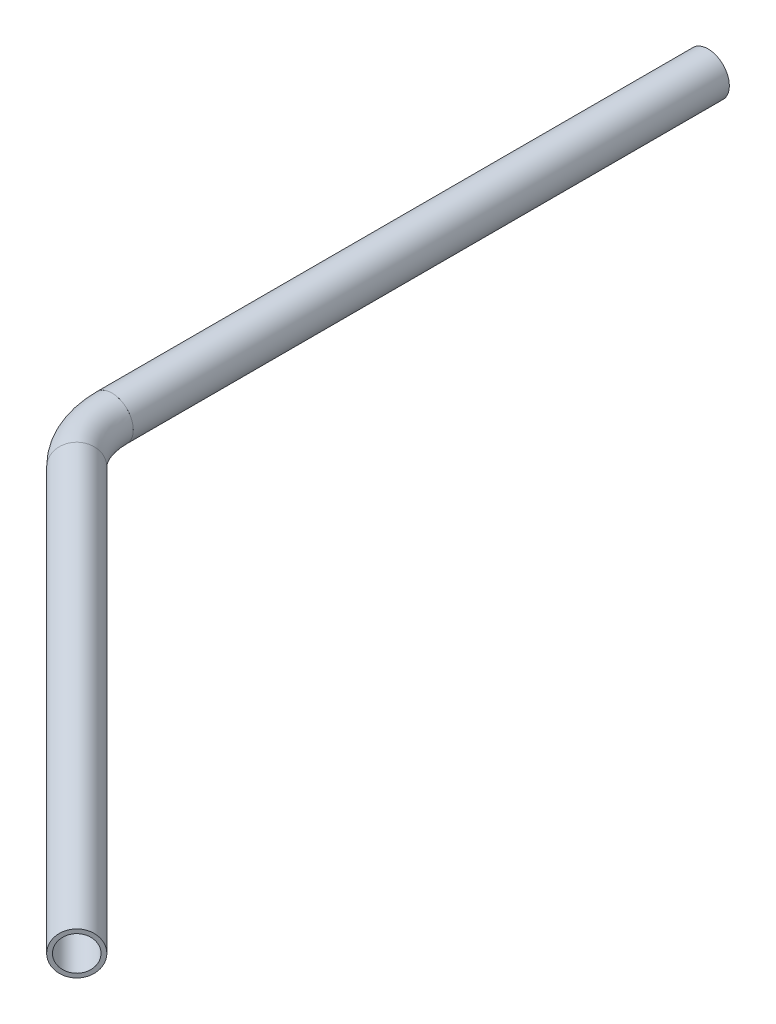
ISO-10303-21;
HEADER;
FILE_DESCRIPTION(('STEP AP214'),'2;1');
FILE_NAME('part.step','',(''),(''),'','','');
FILE_SCHEMA(('AUTOMOTIVE_DESIGN { 1 0 10303 214 1 1 1 1 }'));
ENDSEC;
DATA;
#1=APPLICATION_CONTEXT('core data for automotive mechanical design processes');
#2=APPLICATION_PROTOCOL_DEFINITION('international standard','automotive_design',2000,#1);
#3=PRODUCT_CONTEXT('',#1,'mechanical');
#4=PRODUCT('Part','Part','',(#3));
#5=PRODUCT_RELATED_PRODUCT_CATEGORY('part','',(#4));
#6=PRODUCT_DEFINITION_FORMATION('','',#4);
#7=PRODUCT_DEFINITION_CONTEXT('part definition',#1,'design');
#8=PRODUCT_DEFINITION('design','',#6,#7);
#9=PRODUCT_DEFINITION_SHAPE('','',#8);
#10=(LENGTH_UNIT() NAMED_UNIT(*) SI_UNIT(.MILLI.,.METRE.));
#11=(NAMED_UNIT(*) PLANE_ANGLE_UNIT() SI_UNIT($,.RADIAN.));
#12=(NAMED_UNIT(*) SI_UNIT($,.STERADIAN.) SOLID_ANGLE_UNIT());
#13=UNCERTAINTY_MEASURE_WITH_UNIT(LENGTH_MEASURE(1.E-05),#10,'distance_accuracy_value','');
#14=(GEOMETRIC_REPRESENTATION_CONTEXT(3) GLOBAL_UNCERTAINTY_ASSIGNED_CONTEXT((#13)) GLOBAL_UNIT_ASSIGNED_CONTEXT((#10,
#11,#12)) REPRESENTATION_CONTEXT('',''));
#15=CARTESIAN_POINT('',(0.,0.,0.));
#16=DIRECTION('',(0.,0.,1.));
#17=DIRECTION('',(1.,0.,0.));
#18=AXIS2_PLACEMENT_3D('',#15,#16,#17);
#19=CARTESIAN_POINT('',(19.7410029480264,0.,19.7410029480266));
#20=DIRECTION('',(0.707106781186544,0.,0.707106781186551));
#21=DIRECTION('',(0.707106781186551,0.,-0.707106781186544));
#22=AXIS2_PLACEMENT_3D('',#19,#20,#21);
#23=CYLINDRICAL_SURFACE('',#22,13.6);
#24=CARTESIAN_POINT('',(353.553390593272,0.,353.553390593275));
#25=DIRECTION('',(-0.707106781186544,0.,-0.707106781186551));
#26=DIRECTION('',(-0.707106781186551,0.,0.707106781186544));
#27=AXIS2_PLACEMENT_3D('',#24,#25,#26);
#28=CIRCLE('',#27,13.6);
#29=CARTESIAN_POINT('',(343.936738369135,0.,363.170042817412));
#30=VERTEX_POINT('',#29);
#31=EDGE_CURVE('E57',#30,#30,#28,.T.);
#32=ORIENTED_EDGE('',*,*,#31,.F.);
#33=EDGE_LOOP('',(#32));
#34=FACE_BOUND('',#33,.T.);
#35=CARTESIAN_POINT('',(19.7410029480265,0.,19.7410029480266));
#36=DIRECTION('',(-0.707106781186544,0.,-0.707106781186551));
#37=DIRECTION('',(-0.707106781186551,0.,0.707106781186544));
#38=AXIS2_PLACEMENT_3D('',#35,#36,#37);
#39=CIRCLE('',#38,13.6);
#40=CARTESIAN_POINT('',(10.1243507238894,0.,29.3576551721636));
#41=VERTEX_POINT('',#40);
#42=EDGE_CURVE('E53',#41,#41,#39,.T.);
#43=ORIENTED_EDGE('',*,*,#42,.T.);
#44=EDGE_LOOP('',(#43));
#45=FACE_BOUND('',#44,.T.);
#46=ADVANCED_FACE('F49',(#34,#45),#23,.F.);
#47=CARTESIAN_POINT('',(19.7410029480264,0.,19.7410029480266));
#48=DIRECTION('',(0.707106781186544,0.,0.707106781186551));
#49=DIRECTION('',(0.707106781186551,0.,-0.707106781186544));
#50=AXIS2_PLACEMENT_3D('',#47,#48,#49);
#51=CYLINDRICAL_SURFACE('',#50,16.85);
#52=CARTESIAN_POINT('',(353.553390593272,0.,353.553390593275));
#53=DIRECTION('',(-0.707106781186544,0.,-0.707106781186551));
#54=DIRECTION('',(-0.707106781186551,0.,0.707106781186544));
#55=AXIS2_PLACEMENT_3D('',#52,#53,#54);
#56=CIRCLE('',#55,16.85);
#57=CARTESIAN_POINT('',(341.638641330279,0.,365.468139856269));
#58=VERTEX_POINT('',#57);
#59=EDGE_CURVE('E61',#58,#58,#56,.T.);
#60=ORIENTED_EDGE('',*,*,#59,.T.);
#61=EDGE_LOOP('',(#60));
#62=FACE_BOUND('',#61,.T.);
#63=CARTESIAN_POINT('',(19.7410029480265,0.,19.7410029480266));
#64=DIRECTION('',(-0.707106781186544,0.,-0.707106781186551));
#65=DIRECTION('',(-0.707106781186551,0.,0.707106781186544));
#66=AXIS2_PLACEMENT_3D('',#63,#64,#65);
#67=CIRCLE('',#66,16.85);
#68=CARTESIAN_POINT('',(7.82625368503309,0.,31.6557522110199));
#69=VERTEX_POINT('',#68);
#70=EDGE_CURVE('E12',#69,#69,#67,.T.);
#71=ORIENTED_EDGE('',*,*,#70,.F.);
#72=EDGE_LOOP('',(#71));
#73=FACE_BOUND('',#72,.T.);
#74=ADVANCED_FACE('F76',(#62,#73),#51,.T.);
#75=CARTESIAN_POINT('',(353.553390593272,0.,353.553390593275));
#76=DIRECTION('',(-0.707106781186544,0.,-0.707106781186551));
#77=DIRECTION('',(-0.707106781186551,0.,0.707106781186544));
#78=AXIS2_PLACEMENT_3D('',#75,#76,#77);
#79=PLANE('',#78);
#80=ORIENTED_EDGE('',*,*,#31,.T.);
#81=EDGE_LOOP('',(#80));
#82=FACE_BOUND('',#81,.T.);
#83=ORIENTED_EDGE('',*,*,#59,.F.);
#84=EDGE_LOOP('',(#83));
#85=FACE_BOUND('',#84,.T.);
#86=ADVANCED_FACE('F72',(#82,#85),#79,.F.);
#87=CARTESIAN_POINT('',(19.7410029480265,0.,19.7410029480267));
#88=DIRECTION('',(-0.707106781186544,0.,-0.707106781186551));
#89=DIRECTION('',(-0.707106781186551,0.,0.707106781186544));
#90=AXIS2_PLACEMENT_3D('',#87,#88,#89);
#91=PLANE('',#90);
#92=ORIENTED_EDGE('',*,*,#42,.F.);
#93=EDGE_LOOP('',(#92));
#94=FACE_BOUND('',#93,.T.);
#95=ORIENTED_EDGE('',*,*,#70,.T.);
#96=EDGE_LOOP('',(#95));
#97=FACE_BOUND('',#96,.T.);
#98=ADVANCED_FACE('F51',(#94,#97),#91,.T.);
#99=CLOSED_SHELL('',(#46,#74,#86,#98));
#100=MANIFOLD_SOLID_BREP('B2',#99);
#101=CARTESIAN_POINT('',(67.4,0.,-27.9179941039464));
#102=DIRECTION('',(0.,1.,0.));
#103=DIRECTION('',(0.,0.,1.));
#104=AXIS2_PLACEMENT_3D('',#101,#102,#103);
#105=TOROIDAL_SURFACE('',#104,67.4,13.6);
#106=CARTESIAN_POINT('',(0.,0.,-27.9179941039464));
#107=DIRECTION('',(0.,0.,-1.));
#108=DIRECTION('',(-1.,0.,0.));
#109=AXIS2_PLACEMENT_3D('',#106,#107,#108);
#110=CIRCLE('',#109,13.6);
#111=CARTESIAN_POINT('',(-13.6,0.,-27.9179941039464));
#112=VERTEX_POINT('',#111);
#113=EDGE_CURVE('E154',#112,#112,#110,.T.);
#114=CARTESIAN_POINT('',(19.7410029480265,0.,19.7410029480266));
#115=DIRECTION('',(0.707106781186544,0.,0.707106781186551));
#116=DIRECTION('',(0.707106781186551,0.,-0.707106781186544));
#117=AXIS2_PLACEMENT_3D('',#114,#115,#116);
#118=CIRCLE('',#117,13.6);
#119=CARTESIAN_POINT('',(10.1243507238894,0.,29.3576551721636));
#120=VERTEX_POINT('',#119);
#121=EDGE_CURVE('E144',#120,#120,#118,.T.);
#122=CARTESIAN_POINT('',(67.4,0.,-27.9179941039464));
#123=DIRECTION('',(0.,1.,0.));
#124=DIRECTION('',(0.,0.,1.));
#125=AXIS2_PLACEMENT_3D('',#122,#123,#124);
#126=CIRCLE('',#125,81.);
#127=EDGE_CURVE('',#112,#120,#126,.T.);
#128=ORIENTED_EDGE('',*,*,#113,.T.);
#129=ORIENTED_EDGE('',*,*,#121,.T.);
#130=ORIENTED_EDGE('',*,*,#127,.T.);
#131=ORIENTED_EDGE('',*,*,#127,.F.);
#132=EDGE_LOOP('',(#128,#130,#129,#131));
#133=FACE_BOUND('',#132,.T.);
#134=ADVANCED_FACE('F140',(#133),#105,.F.);
#135=CARTESIAN_POINT('',(67.4,0.,-27.9179941039464));
#136=DIRECTION('',(0.,1.,0.));
#137=DIRECTION('',(0.,0.,1.));
#138=AXIS2_PLACEMENT_3D('',#135,#136,#137);
#139=TOROIDAL_SURFACE('',#138,67.4,16.85);
#140=CARTESIAN_POINT('',(0.,0.,-27.9179941039464));
#141=DIRECTION('',(0.,0.,-1.));
#142=DIRECTION('',(-1.,0.,0.));
#143=AXIS2_PLACEMENT_3D('',#140,#141,#142);
#144=CIRCLE('',#143,16.85);
#145=CARTESIAN_POINT('',(-16.85,0.,-27.9179941039464));
#146=VERTEX_POINT('',#145);
#147=EDGE_CURVE('E148',#146,#146,#144,.T.);
#148=CARTESIAN_POINT('',(19.7410029480265,0.,19.7410029480266));
#149=DIRECTION('',(0.707106781186544,0.,0.707106781186551));
#150=DIRECTION('',(0.707106781186551,0.,-0.707106781186544));
#151=AXIS2_PLACEMENT_3D('',#148,#149,#150);
#152=CIRCLE('',#151,16.85);
#153=CARTESIAN_POINT('',(7.82625368503306,0.,31.6557522110199));
#154=VERTEX_POINT('',#153);
#155=EDGE_CURVE('E48',#154,#154,#152,.T.);
#156=CARTESIAN_POINT('',(67.4,0.,-27.9179941039464));
#157=DIRECTION('',(0.,1.,0.));
#158=DIRECTION('',(0.,0.,1.));
#159=AXIS2_PLACEMENT_3D('',#156,#157,#158);
#160=CIRCLE('',#159,84.25);
#161=EDGE_CURVE('',#146,#154,#160,.T.);
#162=ORIENTED_EDGE('',*,*,#147,.F.);
#163=ORIENTED_EDGE('',*,*,#155,.F.);
#164=ORIENTED_EDGE('',*,*,#161,.T.);
#165=ORIENTED_EDGE('',*,*,#161,.F.);
#166=EDGE_LOOP('',(#162,#164,#163,#165));
#167=FACE_BOUND('',#166,.T.);
#168=ADVANCED_FACE('F167',(#167),#139,.T.);
#169=CARTESIAN_POINT('',(0.,0.,-27.9179941039464));
#170=DIRECTION('',(0.,0.,-1.));
#171=DIRECTION('',(-1.,0.,0.));
#172=AXIS2_PLACEMENT_3D('',#169,#170,#171);
#173=PLANE('',#172);
#174=ORIENTED_EDGE('',*,*,#113,.F.);
#175=EDGE_LOOP('',(#174));
#176=FACE_BOUND('',#175,.T.);
#177=ORIENTED_EDGE('',*,*,#147,.T.);
#178=EDGE_LOOP('',(#177));
#179=FACE_BOUND('',#178,.T.);
#180=ADVANCED_FACE('F163',(#176,#179),#173,.T.);
#181=CARTESIAN_POINT('',(19.7410029480265,0.,19.7410029480267));
#182=DIRECTION('',(0.707106781186544,0.,0.707106781186551));
#183=DIRECTION('',(0.707106781186551,0.,-0.707106781186544));
#184=AXIS2_PLACEMENT_3D('',#181,#182,#183);
#185=PLANE('',#184);
#186=ORIENTED_EDGE('',*,*,#121,.F.);
#187=EDGE_LOOP('',(#186));
#188=FACE_BOUND('',#187,.T.);
#189=ORIENTED_EDGE('',*,*,#155,.T.);
#190=EDGE_LOOP('',(#189));
#191=FACE_BOUND('',#190,.T.);
#192=ADVANCED_FACE('F142',(#188,#191),#185,.T.);
#193=CLOSED_SHELL('',(#134,#168,#180,#192));
#194=MANIFOLD_SOLID_BREP('B7',#193);
#195=CARTESIAN_POINT('',(0.,0.,-500.));
#196=DIRECTION('',(0.,0.,1.));
#197=DIRECTION('',(1.,0.,0.));
#198=AXIS2_PLACEMENT_3D('',#195,#196,#197);
#199=CYLINDRICAL_SURFACE('',#198,13.6);
#200=CARTESIAN_POINT('',(0.,0.,-500.));
#201=DIRECTION('',(0.,0.,-1.));
#202=DIRECTION('',(-1.,0.,0.));
#203=AXIS2_PLACEMENT_3D('',#200,#201,#202);
#204=CIRCLE('',#203,13.6);
#205=CARTESIAN_POINT('',(-13.6,0.,-500.));
#206=VERTEX_POINT('',#205);
#207=EDGE_CURVE('E240',#206,#206,#204,.T.);
#208=ORIENTED_EDGE('',*,*,#207,.T.);
#209=EDGE_LOOP('',(#208));
#210=FACE_BOUND('',#209,.T.);
#211=CARTESIAN_POINT('',(0.,0.,-27.9179941039464));
#212=DIRECTION('',(0.,0.,1.));
#213=DIRECTION('',(1.,0.,0.));
#214=AXIS2_PLACEMENT_3D('',#211,#212,#213);
#215=CIRCLE('',#214,13.6);
#216=CARTESIAN_POINT('',(13.6,0.,-27.9179941039464));
#217=VERTEX_POINT('',#216);
#218=EDGE_CURVE('E230',#217,#217,#215,.T.);
#219=ORIENTED_EDGE('',*,*,#218,.T.);
#220=EDGE_LOOP('',(#219));
#221=FACE_BOUND('',#220,.T.);
#222=ADVANCED_FACE('F226',(#210,#221),#199,.F.);
#223=CARTESIAN_POINT('',(0.,0.,-500.));
#224=DIRECTION('',(0.,0.,1.));
#225=DIRECTION('',(1.,0.,0.));
#226=AXIS2_PLACEMENT_3D('',#223,#224,#225);
#227=CYLINDRICAL_SURFACE('',#226,16.85);
#228=CARTESIAN_POINT('',(0.,0.,-500.));
#229=DIRECTION('',(0.,0.,-1.));
#230=DIRECTION('',(-1.,0.,0.));
#231=AXIS2_PLACEMENT_3D('',#228,#229,#230);
#232=CIRCLE('',#231,16.85);
#233=CARTESIAN_POINT('',(-16.85,0.,-500.));
#234=VERTEX_POINT('',#233);
#235=EDGE_CURVE('E234',#234,#234,#232,.T.);
#236=ORIENTED_EDGE('',*,*,#235,.F.);
#237=EDGE_LOOP('',(#236));
#238=FACE_BOUND('',#237,.T.);
#239=CARTESIAN_POINT('',(0.,0.,-27.9179941039464));
#240=DIRECTION('',(0.,0.,1.));
#241=DIRECTION('',(1.,0.,0.));
#242=AXIS2_PLACEMENT_3D('',#239,#240,#241);
#243=CIRCLE('',#242,16.85);
#244=CARTESIAN_POINT('',(16.85,0.,-27.9179941039464));
#245=VERTEX_POINT('',#244);
#246=EDGE_CURVE('E139',#245,#245,#243,.T.);
#247=ORIENTED_EDGE('',*,*,#246,.F.);
#248=EDGE_LOOP('',(#247));
#249=FACE_BOUND('',#248,.T.);
#250=ADVANCED_FACE('F253',(#238,#249),#227,.T.);
#251=CARTESIAN_POINT('',(0.,0.,-500.));
#252=DIRECTION('',(0.,0.,-1.));
#253=DIRECTION('',(-1.,0.,0.));
#254=AXIS2_PLACEMENT_3D('',#251,#252,#253);
#255=PLANE('',#254);
#256=ORIENTED_EDGE('',*,*,#207,.F.);
#257=EDGE_LOOP('',(#256));
#258=FACE_BOUND('',#257,.T.);
#259=ORIENTED_EDGE('',*,*,#235,.T.);
#260=EDGE_LOOP('',(#259));
#261=FACE_BOUND('',#260,.T.);
#262=ADVANCED_FACE('F249',(#258,#261),#255,.T.);
#263=CARTESIAN_POINT('',(0.,0.,-27.9179941039464));
#264=DIRECTION('',(0.,0.,1.));
#265=DIRECTION('',(1.,0.,0.));
#266=AXIS2_PLACEMENT_3D('',#263,#264,#265);
#267=PLANE('',#266);
#268=ORIENTED_EDGE('',*,*,#218,.F.);
#269=EDGE_LOOP('',(#268));
#270=FACE_BOUND('',#269,.T.);
#271=ORIENTED_EDGE('',*,*,#246,.T.);
#272=EDGE_LOOP('',(#271));
#273=FACE_BOUND('',#272,.T.);
#274=ADVANCED_FACE('F228',(#270,#273),#267,.T.);
#275=CLOSED_SHELL('',(#222,#250,#262,#274));
#276=MANIFOLD_SOLID_BREP('B43',#275);
#277=ADVANCED_BREP_SHAPE_REPRESENTATION('',(#18,#100,#194,#276),#14);
#278=SHAPE_DEFINITION_REPRESENTATION(#9,#277);
ENDSEC;
END-ISO-10303-21;
